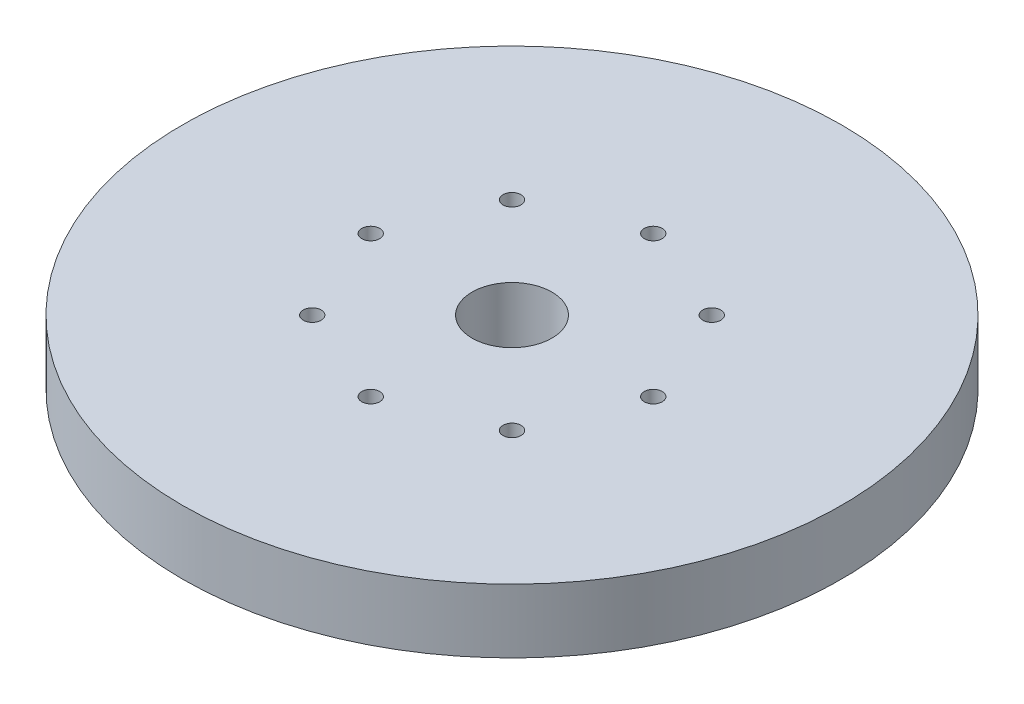
ISO-10303-21;
HEADER;
FILE_DESCRIPTION(('STEP AP214'),'2;1');
FILE_NAME('part.step','',(''),(''),'','','');
FILE_SCHEMA(('AUTOMOTIVE_DESIGN { 1 0 10303 214 1 1 1 1 }'));
ENDSEC;
DATA;
#1=APPLICATION_CONTEXT('core data for automotive mechanical design processes');
#2=APPLICATION_PROTOCOL_DEFINITION('international standard','automotive_design',2000,#1);
#3=PRODUCT_CONTEXT('',#1,'mechanical');
#4=PRODUCT('Part','Part','',(#3));
#5=PRODUCT_RELATED_PRODUCT_CATEGORY('part','',(#4));
#6=PRODUCT_DEFINITION_FORMATION('','',#4);
#7=PRODUCT_DEFINITION_CONTEXT('part definition',#1,'design');
#8=PRODUCT_DEFINITION('design','',#6,#7);
#9=PRODUCT_DEFINITION_SHAPE('','',#8);
#10=(LENGTH_UNIT() NAMED_UNIT(*) SI_UNIT(.MILLI.,.METRE.));
#11=(NAMED_UNIT(*) PLANE_ANGLE_UNIT() SI_UNIT($,.RADIAN.));
#12=(NAMED_UNIT(*) SI_UNIT($,.STERADIAN.) SOLID_ANGLE_UNIT());
#13=UNCERTAINTY_MEASURE_WITH_UNIT(LENGTH_MEASURE(1.E-05),#10,'distance_accuracy_value','');
#14=(GEOMETRIC_REPRESENTATION_CONTEXT(3) GLOBAL_UNCERTAINTY_ASSIGNED_CONTEXT((#13)) GLOBAL_UNIT_ASSIGNED_CONTEXT((#10,
#11,#12)) REPRESENTATION_CONTEXT('',''));
#15=CARTESIAN_POINT('',(0.,0.,0.));
#16=DIRECTION('',(0.,0.,1.));
#17=DIRECTION('',(1.,0.,0.));
#18=AXIS2_PLACEMENT_3D('',#15,#16,#17);
#19=CARTESIAN_POINT('',(0.,16.,0.));
#20=DIRECTION('',(0.,-1.,0.));
#21=DIRECTION('',(0.,0.,-1.));
#22=AXIS2_PLACEMENT_3D('',#19,#20,#21);
#23=CYLINDRICAL_SURFACE('',#22,82.5);
#24=CARTESIAN_POINT('',(0.,16.,0.));
#25=DIRECTION('',(0.,1.,0.));
#26=DIRECTION('',(0.,0.,1.));
#27=AXIS2_PLACEMENT_3D('',#24,#25,#26);
#28=CIRCLE('',#27,82.5);
#29=CARTESIAN_POINT('',(0.,16.,82.5));
#30=VERTEX_POINT('',#29);
#31=EDGE_CURVE('E10',#30,#30,#28,.T.);
#32=ORIENTED_EDGE('',*,*,#31,.F.);
#33=EDGE_LOOP('',(#32));
#34=FACE_BOUND('',#33,.T.);
#35=CARTESIAN_POINT('',(0.,0.,0.));
#36=DIRECTION('',(0.,1.,0.));
#37=DIRECTION('',(0.,0.,1.));
#38=AXIS2_PLACEMENT_3D('',#35,#36,#37);
#39=CIRCLE('',#38,82.5);
#40=CARTESIAN_POINT('',(0.,0.,82.5));
#41=VERTEX_POINT('',#40);
#42=EDGE_CURVE('E37',#41,#41,#39,.T.);
#43=ORIENTED_EDGE('',*,*,#42,.T.);
#44=EDGE_LOOP('',(#43));
#45=FACE_BOUND('',#44,.T.);
#46=ADVANCED_FACE('F40',(#34,#45),#23,.T.);
#47=CARTESIAN_POINT('',(0.,16.,0.));
#48=DIRECTION('',(0.,1.,0.));
#49=DIRECTION('',(0.,0.,1.));
#50=AXIS2_PLACEMENT_3D('',#47,#48,#49);
#51=PLANE('',#50);
#52=CARTESIAN_POINT('',(1.23460515264117E-13,16.,35.360496958871));
#53=DIRECTION('',(0.,1.,0.));
#54=DIRECTION('',(1.,0.,0.));
#55=AXIS2_PLACEMENT_3D('',#52,#53,#54);
#56=CIRCLE('',#55,2.24349560863202);
#57=CARTESIAN_POINT('',(2.24349560863214,16.,35.3604969588709));
#58=VERTEX_POINT('',#57);
#59=EDGE_CURVE('E88',#58,#58,#56,.T.);
#60=ORIENTED_EDGE('',*,*,#59,.F.);
#61=EDGE_LOOP('',(#60));
#62=FACE_BOUND('',#61,.T.);
#63=CARTESIAN_POINT('',(25.0036471857441,16.,25.0036471857438));
#64=DIRECTION('',(0.,1.,0.));
#65=DIRECTION('',(0.707106781186544,0.,-0.707106781186551));
#66=AXIS2_PLACEMENT_3D('',#63,#64,#65);
#67=CIRCLE('',#66,2.24349560863202);
#68=CARTESIAN_POINT('',(26.59003814417,16.,23.4172562273179));
#69=VERTEX_POINT('',#68);
#70=EDGE_CURVE('E79',#69,#69,#67,.T.);
#71=ORIENTED_EDGE('',*,*,#70,.F.);
#72=EDGE_LOOP('',(#71));
#73=FACE_BOUND('',#72,.T.);
#74=CARTESIAN_POINT('',(35.360496958871,16.,0.));
#75=DIRECTION('',(0.,1.,0.));
#76=DIRECTION('',(0.,0.,-1.));
#77=AXIS2_PLACEMENT_3D('',#74,#75,#76);
#78=CIRCLE('',#77,2.24349560863202);
#79=CARTESIAN_POINT('',(35.360496958871,16.,-2.24349560863202));
#80=VERTEX_POINT('',#79);
#81=EDGE_CURVE('E74',#80,#80,#78,.T.);
#82=ORIENTED_EDGE('',*,*,#81,.F.);
#83=EDGE_LOOP('',(#82));
#84=FACE_BOUND('',#83,.T.);
#85=CARTESIAN_POINT('',(25.0036471857437,16.,-25.0036471857442));
#86=DIRECTION('',(0.,1.,0.));
#87=DIRECTION('',(-0.707106781186554,0.,-0.707106781186541));
#88=AXIS2_PLACEMENT_3D('',#85,#86,#87);
#89=CIRCLE('',#88,2.24349560863202);
#90=CARTESIAN_POINT('',(23.4172562273178,16.,-26.5900381441701));
#91=VERTEX_POINT('',#90);
#92=EDGE_CURVE('E70',#91,#91,#89,.T.);
#93=ORIENTED_EDGE('',*,*,#92,.F.);
#94=EDGE_LOOP('',(#93));
#95=FACE_BOUND('',#94,.T.);
#96=CARTESIAN_POINT('',(-3.70381545792352E-13,16.,-35.360496958871));
#97=DIRECTION('',(0.,1.,0.));
#98=DIRECTION('',(-1.,0.,0.));
#99=AXIS2_PLACEMENT_3D('',#96,#97,#98);
#100=CIRCLE('',#99,2.24349560863202);
#101=CARTESIAN_POINT('',(-2.24349560863239,16.,-35.3604969588709));
#102=VERTEX_POINT('',#101);
#103=EDGE_CURVE('E100',#102,#102,#100,.T.);
#104=ORIENTED_EDGE('',*,*,#103,.F.);
#105=EDGE_LOOP('',(#104));
#106=FACE_BOUND('',#105,.T.);
#107=CARTESIAN_POINT('',(-25.0036471857442,16.,-25.0036471857436));
#108=DIRECTION('',(0.,1.,0.));
#109=DIRECTION('',(-0.707106781186539,0.,0.707106781186556));
#110=AXIS2_PLACEMENT_3D('',#107,#108,#109);
#111=CIRCLE('',#110,2.24349560863202);
#112=CARTESIAN_POINT('',(-26.5900381441702,16.,-23.4172562273177));
#113=VERTEX_POINT('',#112);
#114=EDGE_CURVE('E93',#113,#113,#111,.T.);
#115=ORIENTED_EDGE('',*,*,#114,.F.);
#116=EDGE_LOOP('',(#115));
#117=FACE_BOUND('',#116,.T.);
#118=CARTESIAN_POINT('',(-25.0036471857439,16.,25.003647185744));
#119=DIRECTION('',(0.,1.,0.));
#120=DIRECTION('',(0.707106781186549,0.,0.707106781186546));
#121=AXIS2_PLACEMENT_3D('',#118,#119,#120);
#122=CIRCLE('',#121,2.24349560863202);
#123=CARTESIAN_POINT('',(-23.417256227318,16.,26.5900381441699));
#124=VERTEX_POINT('',#123);
#125=EDGE_CURVE('E61',#124,#124,#122,.T.);
#126=ORIENTED_EDGE('',*,*,#125,.F.);
#127=EDGE_LOOP('',(#126));
#128=FACE_BOUND('',#127,.T.);
#129=CARTESIAN_POINT('',(-35.360496958871,16.,0.));
#130=DIRECTION('',(0.,1.,0.));
#131=DIRECTION('',(0.,0.,1.));
#132=AXIS2_PLACEMENT_3D('',#129,#130,#131);
#133=CIRCLE('',#132,2.24349560863202);
#134=CARTESIAN_POINT('',(-35.360496958871,16.,2.24349560863202));
#135=VERTEX_POINT('',#134);
#136=EDGE_CURVE('E54',#135,#135,#133,.T.);
#137=ORIENTED_EDGE('',*,*,#136,.F.);
#138=EDGE_LOOP('',(#137));
#139=FACE_BOUND('',#138,.T.);
#140=CARTESIAN_POINT('',(0.,16.,0.));
#141=DIRECTION('',(0.,1.,0.));
#142=DIRECTION('',(0.,0.,1.));
#143=AXIS2_PLACEMENT_3D('',#140,#141,#142);
#144=CIRCLE('',#143,10.);
#145=CARTESIAN_POINT('',(0.,16.,10.));
#146=VERTEX_POINT('',#145);
#147=EDGE_CURVE('E50',#146,#146,#144,.T.);
#148=ORIENTED_EDGE('',*,*,#147,.F.);
#149=EDGE_LOOP('',(#148));
#150=FACE_BOUND('',#149,.T.);
#151=ORIENTED_EDGE('',*,*,#31,.T.);
#152=EDGE_LOOP('',(#151));
#153=FACE_BOUND('',#152,.T.);
#154=ADVANCED_FACE('F115',(#62,#73,#84,#95,#106,#117,#128,#139,#150,#153),#51,.T.);
#155=CARTESIAN_POINT('',(0.,0.,0.));
#156=DIRECTION('',(0.,1.,0.));
#157=DIRECTION('',(0.,0.,1.));
#158=AXIS2_PLACEMENT_3D('',#155,#156,#157);
#159=PLANE('',#158);
#160=CARTESIAN_POINT('',(0.,0.,0.));
#161=DIRECTION('',(0.,1.,0.));
#162=DIRECTION('',(0.,0.,1.));
#163=AXIS2_PLACEMENT_3D('',#160,#161,#162);
#164=CIRCLE('',#163,10.);
#165=CARTESIAN_POINT('',(0.,0.,10.));
#166=VERTEX_POINT('',#165);
#167=EDGE_CURVE('E47',#166,#166,#164,.T.);
#168=ORIENTED_EDGE('',*,*,#167,.T.);
#169=EDGE_LOOP('',(#168));
#170=FACE_BOUND('',#169,.T.);
#171=ORIENTED_EDGE('',*,*,#42,.F.);
#172=EDGE_LOOP('',(#171));
#173=FACE_BOUND('',#172,.T.);
#174=ADVANCED_FACE('F113',(#170,#173),#159,.F.);
#175=CARTESIAN_POINT('',(0.,16.,0.));
#176=DIRECTION('',(0.,-1.,0.));
#177=DIRECTION('',(0.,0.,-1.));
#178=AXIS2_PLACEMENT_3D('',#175,#176,#177);
#179=CYLINDRICAL_SURFACE('',#178,10.);
#180=ORIENTED_EDGE('',*,*,#147,.T.);
#181=EDGE_LOOP('',(#180));
#182=FACE_BOUND('',#181,.T.);
#183=ORIENTED_EDGE('',*,*,#167,.F.);
#184=EDGE_LOOP('',(#183));
#185=FACE_BOUND('',#184,.T.);
#186=ADVANCED_FACE('F127',(#182,#185),#179,.F.);
#187=CARTESIAN_POINT('',(-35.360496958871,5.018927146769,0.));
#188=DIRECTION('',(0.,1.,0.));
#189=DIRECTION('',(0.,0.,1.));
#190=AXIS2_PLACEMENT_3D('',#187,#188,#189);
#191=CYLINDRICAL_SURFACE('',#190,2.24349560863202);
#192=CARTESIAN_POINT('',(-35.360496958871,5.018927146769,0.));
#193=DIRECTION('',(0.,1.,0.));
#194=DIRECTION('',(0.,0.,1.));
#195=AXIS2_PLACEMENT_3D('',#192,#193,#194);
#196=CIRCLE('',#195,2.24349560863202);
#197=CARTESIAN_POINT('',(-35.360496958871,5.018927146769,2.24349560863202));
#198=VERTEX_POINT('',#197);
#199=EDGE_CURVE('E55',#198,#198,#196,.T.);
#200=ORIENTED_EDGE('',*,*,#199,.F.);
#201=EDGE_LOOP('',(#200));
#202=FACE_BOUND('',#201,.T.);
#203=ORIENTED_EDGE('',*,*,#136,.T.);
#204=EDGE_LOOP('',(#203));
#205=FACE_BOUND('',#204,.T.);
#206=ADVANCED_FACE('F129',(#202,#205),#191,.F.);
#207=CARTESIAN_POINT('',(-35.360496958871,5.018927146769,0.));
#208=DIRECTION('',(0.,1.,0.));
#209=DIRECTION('',(0.,0.,1.));
#210=AXIS2_PLACEMENT_3D('',#207,#208,#209);
#211=PLANE('',#210);
#212=ORIENTED_EDGE('',*,*,#199,.T.);
#213=EDGE_LOOP('',(#212));
#214=FACE_BOUND('',#213,.T.);
#215=ADVANCED_FACE('F157',(#214),#211,.T.);
#216=CARTESIAN_POINT('',(-25.0036471857439,5.018927146769,25.003647185744));
#217=DIRECTION('',(0.,1.,0.));
#218=DIRECTION('',(0.,0.,1.));
#219=AXIS2_PLACEMENT_3D('',#216,#217,#218);
#220=CYLINDRICAL_SURFACE('',#219,2.24349560863202);
#221=CARTESIAN_POINT('',(-25.0036471857439,5.018927146769,25.003647185744));
#222=DIRECTION('',(0.,1.,0.));
#223=DIRECTION('',(0.707106781186549,0.,0.707106781186546));
#224=AXIS2_PLACEMENT_3D('',#221,#222,#223);
#225=CIRCLE('',#224,2.24349560863202);
#226=CARTESIAN_POINT('',(-23.417256227318,5.018927146769,26.5900381441699));
#227=VERTEX_POINT('',#226);
#228=EDGE_CURVE('E59',#227,#227,#225,.T.);
#229=ORIENTED_EDGE('',*,*,#228,.F.);
#230=EDGE_LOOP('',(#229));
#231=FACE_BOUND('',#230,.T.);
#232=ORIENTED_EDGE('',*,*,#125,.T.);
#233=EDGE_LOOP('',(#232));
#234=FACE_BOUND('',#233,.T.);
#235=ADVANCED_FACE('F170',(#231,#234),#220,.F.);
#236=CARTESIAN_POINT('',(-25.0036471857439,5.018927146769,25.003647185744));
#237=DIRECTION('',(0.,1.,0.));
#238=DIRECTION('',(0.707106781186549,0.,0.707106781186546));
#239=AXIS2_PLACEMENT_3D('',#236,#237,#238);
#240=PLANE('',#239);
#241=ORIENTED_EDGE('',*,*,#228,.T.);
#242=EDGE_LOOP('',(#241));
#243=FACE_BOUND('',#242,.T.);
#244=ADVANCED_FACE('F182',(#243),#240,.T.);
#245=CARTESIAN_POINT('',(-25.0036471857442,5.018927146769,-25.0036471857436));
#246=DIRECTION('',(0.,1.,0.));
#247=DIRECTION('',(0.,0.,1.));
#248=AXIS2_PLACEMENT_3D('',#245,#246,#247);
#249=CYLINDRICAL_SURFACE('',#248,2.24349560863202);
#250=CARTESIAN_POINT('',(-25.0036471857442,5.018927146769,-25.0036471857436));
#251=DIRECTION('',(0.,1.,0.));
#252=DIRECTION('',(-0.707106781186539,0.,0.707106781186556));
#253=AXIS2_PLACEMENT_3D('',#250,#251,#252);
#254=CIRCLE('',#253,2.24349560863202);
#255=CARTESIAN_POINT('',(-26.5900381441702,5.018927146769,-23.4172562273177));
#256=VERTEX_POINT('',#255);
#257=EDGE_CURVE('E94',#256,#256,#254,.T.);
#258=ORIENTED_EDGE('',*,*,#257,.F.);
#259=EDGE_LOOP('',(#258));
#260=FACE_BOUND('',#259,.T.);
#261=ORIENTED_EDGE('',*,*,#114,.T.);
#262=EDGE_LOOP('',(#261));
#263=FACE_BOUND('',#262,.T.);
#264=ADVANCED_FACE('F189',(#260,#263),#249,.F.);
#265=CARTESIAN_POINT('',(-25.0036471857442,5.018927146769,-25.0036471857436));
#266=DIRECTION('',(0.,1.,0.));
#267=DIRECTION('',(-0.707106781186539,0.,0.707106781186556));
#268=AXIS2_PLACEMENT_3D('',#265,#266,#267);
#269=PLANE('',#268);
#270=ORIENTED_EDGE('',*,*,#257,.T.);
#271=EDGE_LOOP('',(#270));
#272=FACE_BOUND('',#271,.T.);
#273=ADVANCED_FACE('F107',(#272),#269,.T.);
#274=CARTESIAN_POINT('',(-3.70381545792352E-13,5.018927146769,-35.360496958871));
#275=DIRECTION('',(0.,1.,0.));
#276=DIRECTION('',(0.,0.,1.));
#277=AXIS2_PLACEMENT_3D('',#274,#275,#276);
#278=CYLINDRICAL_SURFACE('',#277,2.24349560863202);
#279=CARTESIAN_POINT('',(-3.70381545792352E-13,5.018927146769,-35.360496958871));
#280=DIRECTION('',(0.,1.,0.));
#281=DIRECTION('',(-1.,0.,0.));
#282=AXIS2_PLACEMENT_3D('',#279,#280,#281);
#283=CIRCLE('',#282,2.24349560863202);
#284=CARTESIAN_POINT('',(-2.24349560863239,5.018927146769,-35.3604969588709));
#285=VERTEX_POINT('',#284);
#286=EDGE_CURVE('E72',#285,#285,#283,.T.);
#287=ORIENTED_EDGE('',*,*,#286,.F.);
#288=EDGE_LOOP('',(#287));
#289=FACE_BOUND('',#288,.T.);
#290=ORIENTED_EDGE('',*,*,#103,.T.);
#291=EDGE_LOOP('',(#290));
#292=FACE_BOUND('',#291,.T.);
#293=ADVANCED_FACE('F104',(#289,#292),#278,.F.);
#294=CARTESIAN_POINT('',(-3.70381545792352E-13,5.018927146769,-35.360496958871));
#295=DIRECTION('',(0.,1.,0.));
#296=DIRECTION('',(-1.,0.,0.));
#297=AXIS2_PLACEMENT_3D('',#294,#295,#296);
#298=PLANE('',#297);
#299=ORIENTED_EDGE('',*,*,#286,.T.);
#300=EDGE_LOOP('',(#299));
#301=FACE_BOUND('',#300,.T.);
#302=ADVANCED_FACE('F103',(#301),#298,.T.);
#303=CARTESIAN_POINT('',(25.0036471857437,5.018927146769,-25.0036471857442));
#304=DIRECTION('',(0.,1.,0.));
#305=DIRECTION('',(0.,0.,1.));
#306=AXIS2_PLACEMENT_3D('',#303,#304,#305);
#307=CYLINDRICAL_SURFACE('',#306,2.24349560863202);
#308=CARTESIAN_POINT('',(25.0036471857437,5.018927146769,-25.0036471857442));
#309=DIRECTION('',(0.,1.,0.));
#310=DIRECTION('',(-0.707106781186554,0.,-0.707106781186541));
#311=AXIS2_PLACEMENT_3D('',#308,#309,#310);
#312=CIRCLE('',#311,2.24349560863202);
#313=CARTESIAN_POINT('',(23.4172562273178,5.018927146769,-26.5900381441701));
#314=VERTEX_POINT('',#313);
#315=EDGE_CURVE('E69',#314,#314,#312,.T.);
#316=ORIENTED_EDGE('',*,*,#315,.F.);
#317=EDGE_LOOP('',(#316));
#318=FACE_BOUND('',#317,.T.);
#319=ORIENTED_EDGE('',*,*,#92,.T.);
#320=EDGE_LOOP('',(#319));
#321=FACE_BOUND('',#320,.T.);
#322=ADVANCED_FACE('F219',(#318,#321),#307,.F.);
#323=CARTESIAN_POINT('',(25.0036471857437,5.018927146769,-25.0036471857442));
#324=DIRECTION('',(0.,1.,0.));
#325=DIRECTION('',(-0.707106781186554,0.,-0.707106781186541));
#326=AXIS2_PLACEMENT_3D('',#323,#324,#325);
#327=PLANE('',#326);
#328=ORIENTED_EDGE('',*,*,#315,.T.);
#329=EDGE_LOOP('',(#328));
#330=FACE_BOUND('',#329,.T.);
#331=ADVANCED_FACE('F227',(#330),#327,.T.);
#332=CARTESIAN_POINT('',(35.360496958871,5.018927146769,0.));
#333=DIRECTION('',(0.,1.,0.));
#334=DIRECTION('',(0.,0.,1.));
#335=AXIS2_PLACEMENT_3D('',#332,#333,#334);
#336=CYLINDRICAL_SURFACE('',#335,2.24349560863202);
#337=CARTESIAN_POINT('',(35.360496958871,5.018927146769,0.));
#338=DIRECTION('',(0.,1.,0.));
#339=DIRECTION('',(0.,0.,-1.));
#340=AXIS2_PLACEMENT_3D('',#337,#338,#339);
#341=CIRCLE('',#340,2.24349560863202);
#342=CARTESIAN_POINT('',(35.360496958871,5.018927146769,-2.24349560863202));
#343=VERTEX_POINT('',#342);
#344=EDGE_CURVE('E80',#343,#343,#341,.T.);
#345=ORIENTED_EDGE('',*,*,#344,.F.);
#346=EDGE_LOOP('',(#345));
#347=FACE_BOUND('',#346,.T.);
#348=ORIENTED_EDGE('',*,*,#81,.T.);
#349=EDGE_LOOP('',(#348));
#350=FACE_BOUND('',#349,.T.);
#351=ADVANCED_FACE('F240',(#347,#350),#336,.F.);
#352=CARTESIAN_POINT('',(35.360496958871,5.018927146769,0.));
#353=DIRECTION('',(0.,1.,0.));
#354=DIRECTION('',(0.,0.,-1.));
#355=AXIS2_PLACEMENT_3D('',#352,#353,#354);
#356=PLANE('',#355);
#357=ORIENTED_EDGE('',*,*,#344,.T.);
#358=EDGE_LOOP('',(#357));
#359=FACE_BOUND('',#358,.T.);
#360=ADVANCED_FACE('F246',(#359),#356,.T.);
#361=CARTESIAN_POINT('',(25.0036471857441,5.018927146769,25.0036471857438));
#362=DIRECTION('',(0.,1.,0.));
#363=DIRECTION('',(0.,0.,1.));
#364=AXIS2_PLACEMENT_3D('',#361,#362,#363);
#365=CYLINDRICAL_SURFACE('',#364,2.24349560863202);
#366=CARTESIAN_POINT('',(25.0036471857441,5.018927146769,25.0036471857438));
#367=DIRECTION('',(0.,1.,0.));
#368=DIRECTION('',(0.707106781186544,0.,-0.707106781186551));
#369=AXIS2_PLACEMENT_3D('',#366,#367,#368);
#370=CIRCLE('',#369,2.24349560863202);
#371=CARTESIAN_POINT('',(26.59003814417,5.018927146769,23.4172562273179));
#372=VERTEX_POINT('',#371);
#373=EDGE_CURVE('E82',#372,#372,#370,.T.);
#374=ORIENTED_EDGE('',*,*,#373,.F.);
#375=EDGE_LOOP('',(#374));
#376=FACE_BOUND('',#375,.T.);
#377=ORIENTED_EDGE('',*,*,#70,.T.);
#378=EDGE_LOOP('',(#377));
#379=FACE_BOUND('',#378,.T.);
#380=ADVANCED_FACE('F254',(#376,#379),#365,.F.);
#381=CARTESIAN_POINT('',(25.0036471857441,5.018927146769,25.0036471857438));
#382=DIRECTION('',(0.,1.,0.));
#383=DIRECTION('',(0.707106781186544,0.,-0.707106781186551));
#384=AXIS2_PLACEMENT_3D('',#381,#382,#383);
#385=PLANE('',#384);
#386=ORIENTED_EDGE('',*,*,#373,.T.);
#387=EDGE_LOOP('',(#386));
#388=FACE_BOUND('',#387,.T.);
#389=ADVANCED_FACE('F262',(#388),#385,.T.);
#390=CARTESIAN_POINT('',(1.23460515264117E-13,5.018927146769,35.360496958871));
#391=DIRECTION('',(0.,1.,0.));
#392=DIRECTION('',(0.,0.,1.));
#393=AXIS2_PLACEMENT_3D('',#390,#391,#392);
#394=CYLINDRICAL_SURFACE('',#393,2.24349560863202);
#395=CARTESIAN_POINT('',(1.23460515264117E-13,5.018927146769,35.360496958871));
#396=DIRECTION('',(0.,1.,0.));
#397=DIRECTION('',(1.,0.,0.));
#398=AXIS2_PLACEMENT_3D('',#395,#396,#397);
#399=CIRCLE('',#398,2.24349560863202);
#400=CARTESIAN_POINT('',(2.24349560863214,5.018927146769,35.3604969588709));
#401=VERTEX_POINT('',#400);
#402=EDGE_CURVE('E63',#401,#401,#399,.T.);
#403=ORIENTED_EDGE('',*,*,#402,.F.);
#404=EDGE_LOOP('',(#403));
#405=FACE_BOUND('',#404,.T.);
#406=ORIENTED_EDGE('',*,*,#59,.T.);
#407=EDGE_LOOP('',(#406));
#408=FACE_BOUND('',#407,.T.);
#409=ADVANCED_FACE('F272',(#405,#408),#394,.F.);
#410=CARTESIAN_POINT('',(1.23460515264117E-13,5.018927146769,35.360496958871));
#411=DIRECTION('',(0.,1.,0.));
#412=DIRECTION('',(1.,0.,0.));
#413=AXIS2_PLACEMENT_3D('',#410,#411,#412);
#414=PLANE('',#413);
#415=ORIENTED_EDGE('',*,*,#402,.T.);
#416=EDGE_LOOP('',(#415));
#417=FACE_BOUND('',#416,.T.);
#418=ADVANCED_FACE('F285',(#417),#414,.T.);
#419=CLOSED_SHELL('',(#46,#154,#174,#186,#206,#215,#235,#244,#264,#273,#293,#302,#322,#331,#351,
#360,#380,#389,#409,#418));
#420=MANIFOLD_SOLID_BREP('B2',#419);
#421=ADVANCED_BREP_SHAPE_REPRESENTATION('',(#18,#420),#14);
#422=SHAPE_DEFINITION_REPRESENTATION(#9,#421);
ENDSEC;
END-ISO-10303-21;
